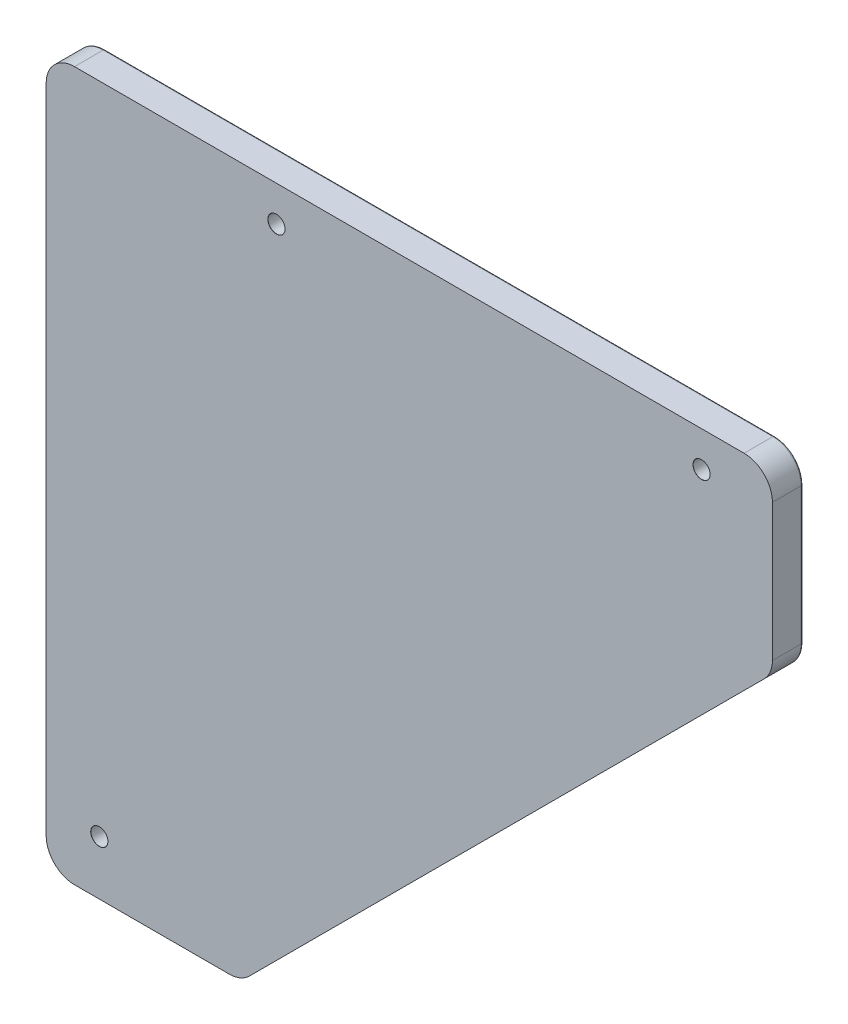
ISO-10303-21;
HEADER;
FILE_DESCRIPTION(('STEP AP214'),'2;1');
FILE_NAME('part.step','',(''),(''),'','','');
FILE_SCHEMA(('AUTOMOTIVE_DESIGN { 1 0 10303 214 1 1 1 1 }'));
ENDSEC;
DATA;
#1=APPLICATION_CONTEXT('core data for automotive mechanical design processes');
#2=APPLICATION_PROTOCOL_DEFINITION('international standard','automotive_design',2000,#1);
#3=PRODUCT_CONTEXT('',#1,'mechanical');
#4=PRODUCT('Part','Part','',(#3));
#5=PRODUCT_RELATED_PRODUCT_CATEGORY('part','',(#4));
#6=PRODUCT_DEFINITION_FORMATION('','',#4);
#7=PRODUCT_DEFINITION_CONTEXT('part definition',#1,'design');
#8=PRODUCT_DEFINITION('design','',#6,#7);
#9=PRODUCT_DEFINITION_SHAPE('','',#8);
#10=(LENGTH_UNIT() NAMED_UNIT(*) SI_UNIT(.MILLI.,.METRE.));
#11=(NAMED_UNIT(*) PLANE_ANGLE_UNIT() SI_UNIT($,.RADIAN.));
#12=(NAMED_UNIT(*) SI_UNIT($,.STERADIAN.) SOLID_ANGLE_UNIT());
#13=UNCERTAINTY_MEASURE_WITH_UNIT(LENGTH_MEASURE(1.E-05),#10,'distance_accuracy_value','');
#14=(GEOMETRIC_REPRESENTATION_CONTEXT(3) GLOBAL_UNCERTAINTY_ASSIGNED_CONTEXT((#13)) GLOBAL_UNIT_ASSIGNED_CONTEXT((#10,
#11,#12)) REPRESENTATION_CONTEXT('',''));
#15=CARTESIAN_POINT('',(0.,0.,0.));
#16=DIRECTION('',(0.,0.,1.));
#17=DIRECTION('',(1.,0.,0.));
#18=AXIS2_PLACEMENT_3D('',#15,#16,#17);
#19=CARTESIAN_POINT('',(-0.01000000000001,0.,8.6));
#20=DIRECTION('',(0.,0.,1.));
#21=DIRECTION('',(1.,0.,0.));
#22=AXIS2_PLACEMENT_3D('',#19,#20,#21);
#23=PLANE('',#22);
#24=CARTESIAN_POINT('',(8.,8.,8.6));
#25=DIRECTION('',(0.,0.,1.));
#26=DIRECTION('',(1.,0.,0.));
#27=AXIS2_PLACEMENT_3D('',#24,#25,#26);
#28=CIRCLE('',#27,8.);
#29=CARTESIAN_POINT('',(8.,0.,8.6));
#30=VERTEX_POINT('',#29);
#31=CARTESIAN_POINT('',(0.,8.,8.6));
#32=VERTEX_POINT('',#31);
#33=EDGE_CURVE('E156',#30,#32,#28,.F.);
#34=ORIENTED_EDGE('',*,*,#33,.F.);
#35=DIRECTION('',(1.,0.,0.));
#36=VECTOR('',#35,1.);
#37=CARTESIAN_POINT('',(-0.01000000000001,0.,8.6));
#38=LINE('',#37,#36);
#39=CARTESIAN_POINT('',(51.6862915010168,0.,8.6));
#40=VERTEX_POINT('',#39);
#41=EDGE_CURVE('E157',#30,#40,#38,.T.);
#42=ORIENTED_EDGE('',*,*,#41,.T.);
#43=CARTESIAN_POINT('',(51.6862915010168,8.00000000000001,8.6));
#44=DIRECTION('',(0.,0.,1.));
#45=DIRECTION('',(1.,0.,0.));
#46=AXIS2_PLACEMENT_3D('',#43,#44,#45);
#47=CIRCLE('',#46,8.);
#48=CARTESIAN_POINT('',(57.3431457505092,2.34314575050762,8.6));
#49=VERTEX_POINT('',#48);
#50=EDGE_CURVE('E145',#49,#40,#47,.F.);
#51=ORIENTED_EDGE('',*,*,#50,.F.);
#52=DIRECTION('',(0.707106781186544,0.707106781186551,0.));
#53=VECTOR('',#52,1.);
#54=CARTESIAN_POINT('',(205.,150.,8.6));
#55=LINE('',#54,#53);
#56=CARTESIAN_POINT('',(202.656854249492,147.656854249492,8.6));
#57=VERTEX_POINT('',#56);
#58=EDGE_CURVE('E164',#49,#57,#55,.T.);
#59=ORIENTED_EDGE('',*,*,#58,.T.);
#60=CARTESIAN_POINT('',(197.,153.313708498985,8.6));
#61=DIRECTION('',(0.,0.,1.));
#62=DIRECTION('',(1.,0.,0.));
#63=AXIS2_PLACEMENT_3D('',#60,#61,#62);
#64=CIRCLE('',#63,8.);
#65=CARTESIAN_POINT('',(205.,153.313708498985,8.6));
#66=VERTEX_POINT('',#65);
#67=EDGE_CURVE('E216',#66,#57,#64,.F.);
#68=ORIENTED_EDGE('',*,*,#67,.F.);
#69=DIRECTION('',(0.,1.,0.));
#70=VECTOR('',#69,1.);
#71=CARTESIAN_POINT('',(205.,200.,8.6));
#72=LINE('',#71,#70);
#73=CARTESIAN_POINT('',(205.,192.,8.6));
#74=VERTEX_POINT('',#73);
#75=EDGE_CURVE('E222',#66,#74,#72,.T.);
#76=ORIENTED_EDGE('',*,*,#75,.T.);
#77=CARTESIAN_POINT('',(197.,192.,8.6));
#78=DIRECTION('',(0.,0.,1.));
#79=DIRECTION('',(1.,0.,0.));
#80=AXIS2_PLACEMENT_3D('',#77,#78,#79);
#81=CIRCLE('',#80,8.);
#82=CARTESIAN_POINT('',(197.,200.,8.6));
#83=VERTEX_POINT('',#82);
#84=EDGE_CURVE('E213',#83,#74,#81,.F.);
#85=ORIENTED_EDGE('',*,*,#84,.F.);
#86=DIRECTION('',(-1.,0.,0.));
#87=VECTOR('',#86,1.);
#88=CARTESIAN_POINT('',(0.,200.,8.6));
#89=LINE('',#88,#87);
#90=CARTESIAN_POINT('',(8.,200.,8.6));
#91=VERTEX_POINT('',#90);
#92=EDGE_CURVE('E225',#83,#91,#89,.T.);
#93=ORIENTED_EDGE('',*,*,#92,.T.);
#94=CARTESIAN_POINT('',(8.,192.,8.6));
#95=DIRECTION('',(0.,0.,1.));
#96=DIRECTION('',(1.,0.,0.));
#97=AXIS2_PLACEMENT_3D('',#94,#95,#96);
#98=CIRCLE('',#97,8.);
#99=CARTESIAN_POINT('',(0.,192.,8.6));
#100=VERTEX_POINT('',#99);
#101=EDGE_CURVE('E218',#100,#91,#98,.F.);
#102=ORIENTED_EDGE('',*,*,#101,.F.);
#103=DIRECTION('',(0.,-1.,0.));
#104=VECTOR('',#103,1.);
#105=CARTESIAN_POINT('',(0.,0.,8.6));
#106=LINE('',#105,#104);
#107=EDGE_CURVE('E228',#100,#32,#106,.T.);
#108=ORIENTED_EDGE('',*,*,#107,.T.);
#109=EDGE_LOOP('',(#34,#42,#51,#59,#68,#76,#85,#93,#102,#108));
#110=FACE_BOUND('',#109,.T.);
#111=CARTESIAN_POINT('',(65.,190.,8.6));
#112=DIRECTION('',(0.,0.,1.));
#113=DIRECTION('',(1.,0.,0.));
#114=AXIS2_PLACEMENT_3D('',#111,#112,#113);
#115=CIRCLE('',#114,2.425);
#116=CARTESIAN_POINT('',(67.425,190.,8.6));
#117=VERTEX_POINT('',#116);
#118=EDGE_CURVE('E209',#117,#117,#115,.T.);
#119=ORIENTED_EDGE('',*,*,#118,.F.);
#120=EDGE_LOOP('',(#119));
#121=FACE_BOUND('',#120,.T.);
#122=CARTESIAN_POINT('',(185.,190.,8.6));
#123=DIRECTION('',(0.,0.,1.));
#124=DIRECTION('',(1.,0.,0.));
#125=AXIS2_PLACEMENT_3D('',#122,#123,#124);
#126=CIRCLE('',#125,2.42500000000001);
#127=CARTESIAN_POINT('',(187.425,190.,8.6));
#128=VERTEX_POINT('',#127);
#129=EDGE_CURVE('E200',#128,#128,#126,.T.);
#130=ORIENTED_EDGE('',*,*,#129,.F.);
#131=EDGE_LOOP('',(#130));
#132=FACE_BOUND('',#131,.T.);
#133=CARTESIAN_POINT('',(15.,15.29,8.6));
#134=DIRECTION('',(0.,0.,1.));
#135=DIRECTION('',(1.,0.,0.));
#136=AXIS2_PLACEMENT_3D('',#133,#134,#135);
#137=CIRCLE('',#136,2.425);
#138=CARTESIAN_POINT('',(17.425,15.29,8.6));
#139=VERTEX_POINT('',#138);
#140=EDGE_CURVE('E186',#139,#139,#137,.T.);
#141=ORIENTED_EDGE('',*,*,#140,.F.);
#142=EDGE_LOOP('',(#141));
#143=FACE_BOUND('',#142,.T.);
#144=ADVANCED_FACE('F35',(#110,#121,#132,#143),#23,.T.);
#145=CARTESIAN_POINT('',(65.,190.,8.6));
#146=DIRECTION('',(0.,0.,1.));
#147=DIRECTION('',(1.,0.,0.));
#148=AXIS2_PLACEMENT_3D('',#145,#146,#147);
#149=CYLINDRICAL_SURFACE('',#148,2.4);
#150=CARTESIAN_POINT('',(65.,190.,0.));
#151=DIRECTION('',(0.,0.,1.));
#152=DIRECTION('',(1.,0.,0.));
#153=AXIS2_PLACEMENT_3D('',#150,#151,#152);
#154=CIRCLE('',#153,2.4);
#155=CARTESIAN_POINT('',(67.4,190.,0.));
#156=VERTEX_POINT('',#155);
#157=EDGE_CURVE('E203',#156,#156,#154,.T.);
#158=ORIENTED_EDGE('',*,*,#157,.F.);
#159=EDGE_LOOP('',(#158));
#160=FACE_BOUND('',#159,.T.);
#161=CARTESIAN_POINT('',(65.,190.,8.575));
#162=DIRECTION('',(0.,0.,1.));
#163=DIRECTION('',(1.,0.,0.));
#164=AXIS2_PLACEMENT_3D('',#161,#162,#163);
#165=CIRCLE('',#164,2.4);
#166=CARTESIAN_POINT('',(67.4,190.,8.575));
#167=VERTEX_POINT('',#166);
#168=EDGE_CURVE('E206',#167,#167,#165,.T.);
#169=ORIENTED_EDGE('',*,*,#168,.T.);
#170=EDGE_LOOP('',(#169));
#171=FACE_BOUND('',#170,.T.);
#172=ADVANCED_FACE('F379',(#160,#171),#149,.F.);
#173=CARTESIAN_POINT('',(65.,190.,8.6));
#174=DIRECTION('',(0.,0.,1.));
#175=DIRECTION('',(1.,0.,0.));
#176=AXIS2_PLACEMENT_3D('',#173,#174,#175);
#177=CONICAL_SURFACE('',#176,2.425,0.785398163397379);
#178=ORIENTED_EDGE('',*,*,#168,.F.);
#179=EDGE_LOOP('',(#178));
#180=FACE_BOUND('',#179,.T.);
#181=ORIENTED_EDGE('',*,*,#118,.T.);
#182=EDGE_LOOP('',(#181));
#183=FACE_BOUND('',#182,.T.);
#184=ADVANCED_FACE('F371',(#180,#183),#177,.F.);
#185=CARTESIAN_POINT('',(8.,8.,109.6));
#186=DIRECTION('',(0.,0.,-1.));
#187=DIRECTION('',(-1.,0.,0.));
#188=AXIS2_PLACEMENT_3D('',#185,#186,#187);
#189=CYLINDRICAL_SURFACE('',#188,8.);
#190=DIRECTION('',(0.,0.,-1.));
#191=VECTOR('',#190,1.);
#192=CARTESIAN_POINT('',(8.,0.,109.6));
#193=LINE('',#192,#191);
#194=CARTESIAN_POINT('',(8.,0.,0.5));
#195=VERTEX_POINT('',#194);
#196=EDGE_CURVE('E169',#30,#195,#193,.T.);
#197=ORIENTED_EDGE('',*,*,#196,.F.);
#198=ORIENTED_EDGE('',*,*,#33,.T.);
#199=DIRECTION('',(0.,0.,-1.));
#200=VECTOR('',#199,1.);
#201=CARTESIAN_POINT('',(0.,8.,109.6));
#202=LINE('',#201,#200);
#203=CARTESIAN_POINT('',(0.,8.,0.5));
#204=VERTEX_POINT('',#203);
#205=EDGE_CURVE('E173',#204,#32,#202,.F.);
#206=ORIENTED_EDGE('',*,*,#205,.F.);
#207=CARTESIAN_POINT('',(8.,8.,0.5));
#208=DIRECTION('',(0.,0.,-1.));
#209=DIRECTION('',(-1.,0.,0.));
#210=AXIS2_PLACEMENT_3D('',#207,#208,#209);
#211=CIRCLE('',#210,8.);
#212=EDGE_CURVE('E249',#204,#195,#211,.F.);
#213=ORIENTED_EDGE('',*,*,#212,.T.);
#214=EDGE_LOOP('',(#197,#198,#206,#213));
#215=FACE_BOUND('',#214,.T.);
#216=ADVANCED_FACE('F248',(#215),#189,.T.);
#217=CARTESIAN_POINT('',(51.6862915010168,8.00000000000001,109.6));
#218=DIRECTION('',(0.,0.,-1.));
#219=DIRECTION('',(-1.,0.,0.));
#220=AXIS2_PLACEMENT_3D('',#217,#218,#219);
#221=CYLINDRICAL_SURFACE('',#220,8.);
#222=DIRECTION('',(0.,0.,-1.));
#223=VECTOR('',#222,1.);
#224=CARTESIAN_POINT('',(57.3431457505092,2.34314575050762,109.6));
#225=LINE('',#224,#223);
#226=CARTESIAN_POINT('',(57.3431457505092,2.34314575050762,0.5));
#227=VERTEX_POINT('',#226);
#228=EDGE_CURVE('E152',#49,#227,#225,.T.);
#229=ORIENTED_EDGE('',*,*,#228,.F.);
#230=ORIENTED_EDGE('',*,*,#50,.T.);
#231=DIRECTION('',(0.,0.,-1.));
#232=VECTOR('',#231,1.);
#233=CARTESIAN_POINT('',(51.6862915010168,0.,109.6));
#234=LINE('',#233,#232);
#235=CARTESIAN_POINT('',(51.6862915010168,0.,0.5));
#236=VERTEX_POINT('',#235);
#237=EDGE_CURVE('E150',#236,#40,#234,.F.);
#238=ORIENTED_EDGE('',*,*,#237,.F.);
#239=CARTESIAN_POINT('',(51.6862915010168,8.00000000000001,0.5));
#240=DIRECTION('',(0.,0.,-1.));
#241=DIRECTION('',(-1.,0.,0.));
#242=AXIS2_PLACEMENT_3D('',#239,#240,#241);
#243=CIRCLE('',#242,8.);
#244=EDGE_CURVE('E312',#236,#227,#243,.F.);
#245=ORIENTED_EDGE('',*,*,#244,.T.);
#246=EDGE_LOOP('',(#229,#230,#238,#245));
#247=FACE_BOUND('',#246,.T.);
#248=ADVANCED_FACE('F147',(#247),#221,.T.);
#249=CARTESIAN_POINT('',(55.0000000000016,0.5,0.5));
#250=DIRECTION('',(-1.,0.,0.));
#251=DIRECTION('',(0.,0.,1.));
#252=AXIS2_PLACEMENT_3D('',#249,#250,#251);
#253=CYLINDRICAL_SURFACE('',#252,0.5);
#254=CARTESIAN_POINT('',(51.6862915010168,0.5,0.5));
#255=DIRECTION('',(1.,0.,0.));
#256=DIRECTION('',(0.,0.,-1.));
#257=AXIS2_PLACEMENT_3D('',#254,#255,#256);
#258=CIRCLE('',#257,0.5);
#259=CARTESIAN_POINT('',(51.6862915010168,0.5,0.));
#260=VERTEX_POINT('',#259);
#261=EDGE_CURVE('E266',#236,#260,#258,.T.);
#262=ORIENTED_EDGE('',*,*,#261,.F.);
#263=DIRECTION('',(1.,0.,0.));
#264=VECTOR('',#263,1.);
#265=CARTESIAN_POINT('',(51.6862915010168,0.,0.5));
#266=LINE('',#265,#264);
#267=EDGE_CURVE('E168',#195,#236,#266,.T.);
#268=ORIENTED_EDGE('',*,*,#267,.F.);
#269=CARTESIAN_POINT('',(8.,0.5,0.5));
#270=DIRECTION('',(-1.,0.,0.));
#271=DIRECTION('',(0.,0.,1.));
#272=AXIS2_PLACEMENT_3D('',#269,#270,#271);
#273=CIRCLE('',#272,0.5);
#274=CARTESIAN_POINT('',(8.,0.499999999999999,0.));
#275=VERTEX_POINT('',#274);
#276=EDGE_CURVE('E212',#275,#195,#273,.T.);
#277=ORIENTED_EDGE('',*,*,#276,.F.);
#278=DIRECTION('',(1.,0.,0.));
#279=VECTOR('',#278,1.);
#280=CARTESIAN_POINT('',(8.00000000000001,0.5,0.));
#281=LINE('',#280,#279);
#282=EDGE_CURVE('E298',#260,#275,#281,.F.);
#283=ORIENTED_EDGE('',*,*,#282,.F.);
#284=EDGE_LOOP('',(#262,#268,#277,#283));
#285=FACE_BOUND('',#284,.T.);
#286=ADVANCED_FACE('F377',(#285),#253,.T.);
#287=CARTESIAN_POINT('',(0.,0.,109.6));
#288=DIRECTION('',(1.,0.,0.));
#289=DIRECTION('',(0.,0.,-1.));
#290=AXIS2_PLACEMENT_3D('',#287,#288,#289);
#291=PLANE('',#290);
#292=ORIENTED_EDGE('',*,*,#107,.F.);
#293=DIRECTION('',(0.,0.,-1.));
#294=VECTOR('',#293,1.);
#295=CARTESIAN_POINT('',(0.,192.,109.6));
#296=LINE('',#295,#294);
#297=CARTESIAN_POINT('',(0.,192.,0.5));
#298=VERTEX_POINT('',#297);
#299=EDGE_CURVE('E170',#100,#298,#296,.T.);
#300=ORIENTED_EDGE('',*,*,#299,.T.);
#301=DIRECTION('',(0.,-1.,0.));
#302=VECTOR('',#301,1.);
#303=CARTESIAN_POINT('',(0.,8.,0.5));
#304=LINE('',#303,#302);
#305=EDGE_CURVE('E244',#298,#204,#304,.T.);
#306=ORIENTED_EDGE('',*,*,#305,.T.);
#307=ORIENTED_EDGE('',*,*,#205,.T.);
#308=EDGE_LOOP('',(#292,#300,#306,#307));
#309=FACE_BOUND('',#308,.T.);
#310=ADVANCED_FACE('F241',(#309),#291,.F.);
#311=CARTESIAN_POINT('',(8.,8.,0.5));
#312=DIRECTION('',(0.,0.,-1.));
#313=DIRECTION('',(-1.,0.,0.));
#314=AXIS2_PLACEMENT_3D('',#311,#312,#313);
#315=TOROIDAL_SURFACE('',#314,7.5,0.5);
#316=ORIENTED_EDGE('',*,*,#276,.T.);
#317=ORIENTED_EDGE('',*,*,#212,.F.);
#318=CARTESIAN_POINT('',(0.5,8.,0.5));
#319=DIRECTION('',(0.,1.,0.));
#320=DIRECTION('',(0.,0.,1.));
#321=AXIS2_PLACEMENT_3D('',#318,#319,#320);
#322=CIRCLE('',#321,0.5);
#323=CARTESIAN_POINT('',(0.5,8.,0.));
#324=VERTEX_POINT('',#323);
#325=EDGE_CURVE('E256',#324,#204,#322,.T.);
#326=ORIENTED_EDGE('',*,*,#325,.F.);
#327=CARTESIAN_POINT('',(8.,8.,0.));
#328=DIRECTION('',(0.,0.,-1.));
#329=DIRECTION('',(-1.,0.,0.));
#330=AXIS2_PLACEMENT_3D('',#327,#328,#329);
#331=CIRCLE('',#330,7.5);
#332=EDGE_CURVE('E300',#275,#324,#331,.T.);
#333=ORIENTED_EDGE('',*,*,#332,.F.);
#334=EDGE_LOOP('',(#316,#317,#326,#333));
#335=FACE_BOUND('',#334,.T.);
#336=ADVANCED_FACE('F254',(#335),#315,.T.);
#337=CARTESIAN_POINT('',(205.,150.,109.6));
#338=DIRECTION('',(-0.707106781186551,0.707106781186544,0.));
#339=DIRECTION('',(-0.707106781186544,-0.707106781186551,0.));
#340=AXIS2_PLACEMENT_3D('',#337,#338,#339);
#341=PLANE('',#340);
#342=ORIENTED_EDGE('',*,*,#58,.F.);
#343=ORIENTED_EDGE('',*,*,#228,.T.);
#344=DIRECTION('',(0.707106781186544,0.707106781186551,0.));
#345=VECTOR('',#344,1.);
#346=CARTESIAN_POINT('',(202.656854249492,147.656854249492,0.5));
#347=LINE('',#346,#345);
#348=CARTESIAN_POINT('',(202.656854249492,147.656854249492,0.5));
#349=VERTEX_POINT('',#348);
#350=EDGE_CURVE('E314',#227,#349,#347,.T.);
#351=ORIENTED_EDGE('',*,*,#350,.T.);
#352=DIRECTION('',(0.,0.,-1.));
#353=VECTOR('',#352,1.);
#354=CARTESIAN_POINT('',(202.656854249492,147.656854249492,109.6));
#355=LINE('',#354,#353);
#356=EDGE_CURVE('E39',#349,#57,#355,.F.);
#357=ORIENTED_EDGE('',*,*,#356,.T.);
#358=EDGE_LOOP('',(#342,#343,#351,#357));
#359=FACE_BOUND('',#358,.T.);
#360=ADVANCED_FACE('F396',(#359),#341,.F.);
#361=CARTESIAN_POINT('',(51.6862915010168,8.00000000000001,0.5));
#362=DIRECTION('',(0.,0.,-1.));
#363=DIRECTION('',(-1.,0.,0.));
#364=AXIS2_PLACEMENT_3D('',#361,#362,#363);
#365=TOROIDAL_SURFACE('',#364,7.5,0.5);
#366=ORIENTED_EDGE('',*,*,#261,.T.);
#367=CARTESIAN_POINT('',(51.6862915010168,8.00000000000001,0.));
#368=DIRECTION('',(0.,0.,-1.));
#369=DIRECTION('',(-1.,0.,0.));
#370=AXIS2_PLACEMENT_3D('',#367,#368,#369);
#371=CIRCLE('',#370,7.5);
#372=CARTESIAN_POINT('',(56.9895923599159,2.6966991411009,0.));
#373=VERTEX_POINT('',#372);
#374=EDGE_CURVE('E296',#373,#260,#371,.T.);
#375=ORIENTED_EDGE('',*,*,#374,.F.);
#376=CARTESIAN_POINT('',(56.9895923599159,2.6966991411009,0.5));
#377=DIRECTION('',(0.707106781186549,0.707106781186546,0.));
#378=DIRECTION('',(-0.707106781186546,0.707106781186549,0.));
#379=AXIS2_PLACEMENT_3D('',#376,#377,#378);
#380=CIRCLE('',#379,0.5);
#381=EDGE_CURVE('E265',#227,#373,#380,.T.);
#382=ORIENTED_EDGE('',*,*,#381,.F.);
#383=ORIENTED_EDGE('',*,*,#244,.F.);
#384=EDGE_LOOP('',(#366,#375,#382,#383));
#385=FACE_BOUND('',#384,.T.);
#386=ADVANCED_FACE('F386',(#385),#365,.T.);
#387=CARTESIAN_POINT('',(8.,192.,109.6));
#388=DIRECTION('',(0.,0.,-1.));
#389=DIRECTION('',(-1.,0.,0.));
#390=AXIS2_PLACEMENT_3D('',#387,#388,#389);
#391=CYLINDRICAL_SURFACE('',#390,8.);
#392=ORIENTED_EDGE('',*,*,#299,.F.);
#393=ORIENTED_EDGE('',*,*,#101,.T.);
#394=DIRECTION('',(0.,0.,-1.));
#395=VECTOR('',#394,1.);
#396=CARTESIAN_POINT('',(8.,200.,109.6));
#397=LINE('',#396,#395);
#398=CARTESIAN_POINT('',(8.,200.,0.5));
#399=VERTEX_POINT('',#398);
#400=EDGE_CURVE('E234',#399,#91,#397,.F.);
#401=ORIENTED_EDGE('',*,*,#400,.F.);
#402=CARTESIAN_POINT('',(8.,192.,0.5));
#403=DIRECTION('',(0.,0.,-1.));
#404=DIRECTION('',(-1.,0.,0.));
#405=AXIS2_PLACEMENT_3D('',#402,#403,#404);
#406=CIRCLE('',#405,8.);
#407=EDGE_CURVE('E307',#399,#298,#406,.F.);
#408=ORIENTED_EDGE('',*,*,#407,.T.);
#409=EDGE_LOOP('',(#392,#393,#401,#408));
#410=FACE_BOUND('',#409,.T.);
#411=ADVANCED_FACE('F344',(#410),#391,.T.);
#412=CARTESIAN_POINT('',(0.5,0.,0.5));
#413=DIRECTION('',(0.,1.,0.));
#414=DIRECTION('',(0.,0.,1.));
#415=AXIS2_PLACEMENT_3D('',#412,#413,#414);
#416=CYLINDRICAL_SURFACE('',#415,0.5);
#417=ORIENTED_EDGE('',*,*,#325,.T.);
#418=ORIENTED_EDGE('',*,*,#305,.F.);
#419=CARTESIAN_POINT('',(0.5,192.,0.5));
#420=DIRECTION('',(0.,1.,0.));
#421=DIRECTION('',(0.,0.,1.));
#422=AXIS2_PLACEMENT_3D('',#419,#420,#421);
#423=CIRCLE('',#422,0.5);
#424=CARTESIAN_POINT('',(0.5,192.,0.));
#425=VERTEX_POINT('',#424);
#426=EDGE_CURVE('E269',#425,#298,#423,.T.);
#427=ORIENTED_EDGE('',*,*,#426,.F.);
#428=DIRECTION('',(0.,-1.,0.));
#429=VECTOR('',#428,1.);
#430=CARTESIAN_POINT('',(0.5,192.,0.));
#431=LINE('',#430,#429);
#432=EDGE_CURVE('E264',#324,#425,#431,.F.);
#433=ORIENTED_EDGE('',*,*,#432,.F.);
#434=EDGE_LOOP('',(#417,#418,#427,#433));
#435=FACE_BOUND('',#434,.T.);
#436=ADVANCED_FACE('F261',(#435),#416,.T.);
#437=CARTESIAN_POINT('',(197.,153.313708498985,109.6));
#438=DIRECTION('',(0.,0.,-1.));
#439=DIRECTION('',(-1.,0.,0.));
#440=AXIS2_PLACEMENT_3D('',#437,#438,#439);
#441=CYLINDRICAL_SURFACE('',#440,8.);
#442=DIRECTION('',(0.,0.,-1.));
#443=VECTOR('',#442,1.);
#444=CARTESIAN_POINT('',(205.,153.313708498985,109.6));
#445=LINE('',#444,#443);
#446=CARTESIAN_POINT('',(205.,153.313708498985,0.5));
#447=VERTEX_POINT('',#446);
#448=EDGE_CURVE('E230',#66,#447,#445,.T.);
#449=ORIENTED_EDGE('',*,*,#448,.F.);
#450=ORIENTED_EDGE('',*,*,#67,.T.);
#451=ORIENTED_EDGE('',*,*,#356,.F.);
#452=CARTESIAN_POINT('',(197.,153.313708498985,0.5));
#453=DIRECTION('',(0.,0.,-1.));
#454=DIRECTION('',(-1.,0.,0.));
#455=AXIS2_PLACEMENT_3D('',#452,#453,#454);
#456=CIRCLE('',#455,8.);
#457=EDGE_CURVE('E316',#349,#447,#456,.F.);
#458=ORIENTED_EDGE('',*,*,#457,.T.);
#459=EDGE_LOOP('',(#449,#450,#451,#458));
#460=FACE_BOUND('',#459,.T.);
#461=ADVANCED_FACE('F357',(#460),#441,.T.);
#462=CARTESIAN_POINT('',(204.646446609407,150.353553390593,0.5));
#463=DIRECTION('',(-0.707106781186544,-0.707106781186551,0.));
#464=DIRECTION('',(0.707106781186551,-0.707106781186544,0.));
#465=AXIS2_PLACEMENT_3D('',#462,#463,#464);
#466=CYLINDRICAL_SURFACE('',#465,0.5);
#467=ORIENTED_EDGE('',*,*,#381,.T.);
#468=DIRECTION('',(0.707106781186544,0.707106781186551,0.));
#469=VECTOR('',#468,1.);
#470=CARTESIAN_POINT('',(56.9895923599159,2.69669914110088,0.));
#471=LINE('',#470,#469);
#472=CARTESIAN_POINT('',(202.303300858899,148.010407640086,0.));
#473=VERTEX_POINT('',#472);
#474=EDGE_CURVE('E294',#473,#373,#471,.F.);
#475=ORIENTED_EDGE('',*,*,#474,.F.);
#476=CARTESIAN_POINT('',(202.303300858899,148.010407640086,0.5));
#477=DIRECTION('',(0.70710678118652,0.707106781186575,0.));
#478=DIRECTION('',(-0.707106781186575,0.70710678118652,0.));
#479=AXIS2_PLACEMENT_3D('',#476,#477,#478);
#480=CIRCLE('',#479,0.5);
#481=EDGE_CURVE('E276',#349,#473,#480,.T.);
#482=ORIENTED_EDGE('',*,*,#481,.F.);
#483=ORIENTED_EDGE('',*,*,#350,.F.);
#484=EDGE_LOOP('',(#467,#475,#482,#483));
#485=FACE_BOUND('',#484,.T.);
#486=ADVANCED_FACE('F349',(#485),#466,.T.);
#487=CARTESIAN_POINT('',(8.,192.,0.5));
#488=DIRECTION('',(0.,0.,-1.));
#489=DIRECTION('',(-1.,0.,0.));
#490=AXIS2_PLACEMENT_3D('',#487,#488,#489);
#491=TOROIDAL_SURFACE('',#490,7.5,0.5);
#492=ORIENTED_EDGE('',*,*,#426,.T.);
#493=ORIENTED_EDGE('',*,*,#407,.F.);
#494=CARTESIAN_POINT('',(8.,199.5,0.5));
#495=DIRECTION('',(1.,0.,0.));
#496=DIRECTION('',(0.,0.,-1.));
#497=AXIS2_PLACEMENT_3D('',#494,#495,#496);
#498=CIRCLE('',#497,0.5);
#499=CARTESIAN_POINT('',(8.,199.5,0.));
#500=VERTEX_POINT('',#499);
#501=EDGE_CURVE('E279',#500,#399,#498,.T.);
#502=ORIENTED_EDGE('',*,*,#501,.F.);
#503=CARTESIAN_POINT('',(8.,192.,0.));
#504=DIRECTION('',(0.,0.,-1.));
#505=DIRECTION('',(-1.,0.,0.));
#506=AXIS2_PLACEMENT_3D('',#503,#504,#505);
#507=CIRCLE('',#506,7.5);
#508=EDGE_CURVE('E303',#425,#500,#507,.T.);
#509=ORIENTED_EDGE('',*,*,#508,.F.);
#510=EDGE_LOOP('',(#492,#493,#502,#509));
#511=FACE_BOUND('',#510,.T.);
#512=ADVANCED_FACE('F346',(#511),#491,.T.);
#513=CARTESIAN_POINT('',(205.,200.,109.6));
#514=DIRECTION('',(-1.,0.,0.));
#515=DIRECTION('',(0.,0.,1.));
#516=AXIS2_PLACEMENT_3D('',#513,#514,#515);
#517=PLANE('',#516);
#518=ORIENTED_EDGE('',*,*,#75,.F.);
#519=ORIENTED_EDGE('',*,*,#448,.T.);
#520=DIRECTION('',(0.,1.,0.));
#521=VECTOR('',#520,1.);
#522=CARTESIAN_POINT('',(205.,192.,0.5));
#523=LINE('',#522,#521);
#524=CARTESIAN_POINT('',(205.,192.,0.5));
#525=VERTEX_POINT('',#524);
#526=EDGE_CURVE('E52',#447,#525,#523,.T.);
#527=ORIENTED_EDGE('',*,*,#526,.T.);
#528=DIRECTION('',(0.,0.,-1.));
#529=VECTOR('',#528,1.);
#530=CARTESIAN_POINT('',(205.,192.,109.6));
#531=LINE('',#530,#529);
#532=EDGE_CURVE('E232',#525,#74,#531,.F.);
#533=ORIENTED_EDGE('',*,*,#532,.T.);
#534=EDGE_LOOP('',(#518,#519,#527,#533));
#535=FACE_BOUND('',#534,.T.);
#536=ADVANCED_FACE('F348',(#535),#517,.F.);
#537=CARTESIAN_POINT('',(197.,153.313708498985,0.5));
#538=DIRECTION('',(0.,0.,-1.));
#539=DIRECTION('',(-1.,0.,0.));
#540=AXIS2_PLACEMENT_3D('',#537,#538,#539);
#541=TOROIDAL_SURFACE('',#540,7.5,0.5);
#542=ORIENTED_EDGE('',*,*,#481,.T.);
#543=CARTESIAN_POINT('',(197.,153.313708498985,0.));
#544=DIRECTION('',(0.,0.,-1.));
#545=DIRECTION('',(-1.,0.,0.));
#546=AXIS2_PLACEMENT_3D('',#543,#544,#545);
#547=CIRCLE('',#546,7.5);
#548=CARTESIAN_POINT('',(204.5,153.313708498985,0.));
#549=VERTEX_POINT('',#548);
#550=EDGE_CURVE('E292',#549,#473,#547,.T.);
#551=ORIENTED_EDGE('',*,*,#550,.F.);
#552=CARTESIAN_POINT('',(204.5,153.313708498985,0.5));
#553=DIRECTION('',(0.,1.,0.));
#554=DIRECTION('',(0.,0.,1.));
#555=AXIS2_PLACEMENT_3D('',#552,#553,#554);
#556=CIRCLE('',#555,0.5);
#557=EDGE_CURVE('E282',#447,#549,#556,.T.);
#558=ORIENTED_EDGE('',*,*,#557,.F.);
#559=ORIENTED_EDGE('',*,*,#457,.F.);
#560=EDGE_LOOP('',(#542,#551,#558,#559));
#561=FACE_BOUND('',#560,.T.);
#562=ADVANCED_FACE('F355',(#561),#541,.T.);
#563=CARTESIAN_POINT('',(204.5,200.,0.5));
#564=DIRECTION('',(0.,-1.,0.));
#565=DIRECTION('',(0.,0.,-1.));
#566=AXIS2_PLACEMENT_3D('',#563,#564,#565);
#567=CYLINDRICAL_SURFACE('',#566,0.5);
#568=ORIENTED_EDGE('',*,*,#557,.T.);
#569=DIRECTION('',(0.,1.,0.));
#570=VECTOR('',#569,1.);
#571=CARTESIAN_POINT('',(204.5,153.313708498985,0.));
#572=LINE('',#571,#570);
#573=CARTESIAN_POINT('',(204.5,192.,0.));
#574=VERTEX_POINT('',#573);
#575=EDGE_CURVE('E290',#574,#549,#572,.F.);
#576=ORIENTED_EDGE('',*,*,#575,.F.);
#577=CARTESIAN_POINT('',(204.5,192.,0.5));
#578=DIRECTION('',(0.,1.,0.));
#579=DIRECTION('',(0.,0.,1.));
#580=AXIS2_PLACEMENT_3D('',#577,#578,#579);
#581=CIRCLE('',#580,0.5);
#582=EDGE_CURVE('E11',#525,#574,#581,.T.);
#583=ORIENTED_EDGE('',*,*,#582,.F.);
#584=ORIENTED_EDGE('',*,*,#526,.F.);
#585=EDGE_LOOP('',(#568,#576,#583,#584));
#586=FACE_BOUND('',#585,.T.);
#587=ADVANCED_FACE('F329',(#586),#567,.T.);
#588=CARTESIAN_POINT('',(197.,192.,109.6));
#589=DIRECTION('',(0.,0.,-1.));
#590=DIRECTION('',(-1.,0.,0.));
#591=AXIS2_PLACEMENT_3D('',#588,#589,#590);
#592=CYLINDRICAL_SURFACE('',#591,8.);
#593=DIRECTION('',(0.,0.,-1.));
#594=VECTOR('',#593,1.);
#595=CARTESIAN_POINT('',(197.,200.,109.6));
#596=LINE('',#595,#594);
#597=CARTESIAN_POINT('',(197.,200.,0.5));
#598=VERTEX_POINT('',#597);
#599=EDGE_CURVE('E60',#83,#598,#596,.T.);
#600=ORIENTED_EDGE('',*,*,#599,.F.);
#601=ORIENTED_EDGE('',*,*,#84,.T.);
#602=ORIENTED_EDGE('',*,*,#532,.F.);
#603=CARTESIAN_POINT('',(197.,192.,0.5));
#604=DIRECTION('',(0.,0.,-1.));
#605=DIRECTION('',(-1.,0.,0.));
#606=AXIS2_PLACEMENT_3D('',#603,#604,#605);
#607=CIRCLE('',#606,8.);
#608=EDGE_CURVE('E189',#525,#598,#607,.F.);
#609=ORIENTED_EDGE('',*,*,#608,.T.);
#610=EDGE_LOOP('',(#600,#601,#602,#609));
#611=FACE_BOUND('',#610,.T.);
#612=ADVANCED_FACE('F37',(#611),#592,.T.);
#613=CARTESIAN_POINT('',(0.,199.5,0.5));
#614=DIRECTION('',(1.,0.,0.));
#615=DIRECTION('',(0.,0.,-1.));
#616=AXIS2_PLACEMENT_3D('',#613,#614,#615);
#617=CYLINDRICAL_SURFACE('',#616,0.5);
#618=ORIENTED_EDGE('',*,*,#501,.T.);
#619=DIRECTION('',(-1.,0.,0.));
#620=VECTOR('',#619,1.);
#621=CARTESIAN_POINT('',(8.,200.,0.5));
#622=LINE('',#621,#620);
#623=EDGE_CURVE('E215',#598,#399,#622,.T.);
#624=ORIENTED_EDGE('',*,*,#623,.F.);
#625=CARTESIAN_POINT('',(197.,199.5,0.5));
#626=DIRECTION('',(1.,0.,0.));
#627=DIRECTION('',(0.,0.,-1.));
#628=AXIS2_PLACEMENT_3D('',#625,#626,#627);
#629=CIRCLE('',#628,0.5);
#630=CARTESIAN_POINT('',(197.,199.5,0.));
#631=VERTEX_POINT('',#630);
#632=EDGE_CURVE('E44',#631,#598,#629,.T.);
#633=ORIENTED_EDGE('',*,*,#632,.F.);
#634=DIRECTION('',(-1.,0.,0.));
#635=VECTOR('',#634,1.);
#636=CARTESIAN_POINT('',(197.,199.5,0.));
#637=LINE('',#636,#635);
#638=EDGE_CURVE('E305',#500,#631,#637,.F.);
#639=ORIENTED_EDGE('',*,*,#638,.F.);
#640=EDGE_LOOP('',(#618,#624,#633,#639));
#641=FACE_BOUND('',#640,.T.);
#642=ADVANCED_FACE('F339',(#641),#617,.T.);
#643=CARTESIAN_POINT('',(197.,192.,0.5));
#644=DIRECTION('',(0.,0.,-1.));
#645=DIRECTION('',(-1.,0.,0.));
#646=AXIS2_PLACEMENT_3D('',#643,#644,#645);
#647=TOROIDAL_SURFACE('',#646,7.5,0.5);
#648=ORIENTED_EDGE('',*,*,#632,.T.);
#649=ORIENTED_EDGE('',*,*,#608,.F.);
#650=ORIENTED_EDGE('',*,*,#582,.T.);
#651=CARTESIAN_POINT('',(197.,192.,0.));
#652=DIRECTION('',(0.,0.,-1.));
#653=DIRECTION('',(-1.,0.,0.));
#654=AXIS2_PLACEMENT_3D('',#651,#652,#653);
#655=CIRCLE('',#654,7.5);
#656=EDGE_CURVE('E287',#631,#574,#655,.T.);
#657=ORIENTED_EDGE('',*,*,#656,.F.);
#658=EDGE_LOOP('',(#648,#649,#650,#657));
#659=FACE_BOUND('',#658,.T.);
#660=ADVANCED_FACE('F323',(#659),#647,.T.);
#661=CARTESIAN_POINT('',(0.,0.,0.));
#662=DIRECTION('',(0.,0.,-1.));
#663=DIRECTION('',(-1.,0.,0.));
#664=AXIS2_PLACEMENT_3D('',#661,#662,#663);
#665=PLANE('',#664);
#666=ORIENTED_EDGE('',*,*,#638,.T.);
#667=ORIENTED_EDGE('',*,*,#656,.T.);
#668=ORIENTED_EDGE('',*,*,#575,.T.);
#669=ORIENTED_EDGE('',*,*,#550,.T.);
#670=ORIENTED_EDGE('',*,*,#474,.T.);
#671=ORIENTED_EDGE('',*,*,#374,.T.);
#672=ORIENTED_EDGE('',*,*,#282,.T.);
#673=ORIENTED_EDGE('',*,*,#332,.T.);
#674=ORIENTED_EDGE('',*,*,#432,.T.);
#675=ORIENTED_EDGE('',*,*,#508,.T.);
#676=EDGE_LOOP('',(#666,#667,#668,#669,#670,#671,#672,#673,#674,#675));
#677=FACE_BOUND('',#676,.T.);
#678=ORIENTED_EDGE('',*,*,#157,.T.);
#679=EDGE_LOOP('',(#678));
#680=FACE_BOUND('',#679,.T.);
#681=CARTESIAN_POINT('',(185.,190.,0.));
#682=DIRECTION('',(0.,0.,1.));
#683=DIRECTION('',(1.,0.,0.));
#684=AXIS2_PLACEMENT_3D('',#681,#682,#683);
#685=CIRCLE('',#684,2.39999999999999);
#686=CARTESIAN_POINT('',(187.4,190.,0.));
#687=VERTEX_POINT('',#686);
#688=EDGE_CURVE('E194',#687,#687,#685,.T.);
#689=ORIENTED_EDGE('',*,*,#688,.T.);
#690=EDGE_LOOP('',(#689));
#691=FACE_BOUND('',#690,.T.);
#692=CARTESIAN_POINT('',(15.,15.29,0.));
#693=DIRECTION('',(0.,0.,1.));
#694=DIRECTION('',(1.,0.,0.));
#695=AXIS2_PLACEMENT_3D('',#692,#693,#694);
#696=CIRCLE('',#695,2.4);
#697=CARTESIAN_POINT('',(17.4,15.29,0.));
#698=VERTEX_POINT('',#697);
#699=EDGE_CURVE('E178',#698,#698,#696,.T.);
#700=ORIENTED_EDGE('',*,*,#699,.T.);
#701=EDGE_LOOP('',(#700));
#702=FACE_BOUND('',#701,.T.);
#703=ADVANCED_FACE('F333',(#677,#680,#691,#702),#665,.T.);
#704=CARTESIAN_POINT('',(0.,200.,109.6));
#705=DIRECTION('',(0.,-1.,0.));
#706=DIRECTION('',(0.,0.,-1.));
#707=AXIS2_PLACEMENT_3D('',#704,#705,#706);
#708=PLANE('',#707);
#709=ORIENTED_EDGE('',*,*,#92,.F.);
#710=ORIENTED_EDGE('',*,*,#599,.T.);
#711=ORIENTED_EDGE('',*,*,#623,.T.);
#712=ORIENTED_EDGE('',*,*,#400,.T.);
#713=EDGE_LOOP('',(#709,#710,#711,#712));
#714=FACE_BOUND('',#713,.T.);
#715=ADVANCED_FACE('F341',(#714),#708,.F.);
#716=CARTESIAN_POINT('',(55.0000000000016,0.,109.6));
#717=DIRECTION('',(0.,1.,0.));
#718=DIRECTION('',(0.,0.,1.));
#719=AXIS2_PLACEMENT_3D('',#716,#717,#718);
#720=PLANE('',#719);
#721=ORIENTED_EDGE('',*,*,#41,.F.);
#722=ORIENTED_EDGE('',*,*,#196,.T.);
#723=ORIENTED_EDGE('',*,*,#267,.T.);
#724=ORIENTED_EDGE('',*,*,#237,.T.);
#725=EDGE_LOOP('',(#721,#722,#723,#724));
#726=FACE_BOUND('',#725,.T.);
#727=ADVANCED_FACE('F166',(#726),#720,.F.);
#728=CARTESIAN_POINT('',(185.,190.,8.6));
#729=DIRECTION('',(0.,0.,1.));
#730=DIRECTION('',(1.,0.,0.));
#731=AXIS2_PLACEMENT_3D('',#728,#729,#730);
#732=CYLINDRICAL_SURFACE('',#731,2.39999999999999);
#733=ORIENTED_EDGE('',*,*,#688,.F.);
#734=EDGE_LOOP('',(#733));
#735=FACE_BOUND('',#734,.T.);
#736=CARTESIAN_POINT('',(185.,190.,8.575));
#737=DIRECTION('',(0.,0.,1.));
#738=DIRECTION('',(1.,0.,0.));
#739=AXIS2_PLACEMENT_3D('',#736,#737,#738);
#740=CIRCLE('',#739,2.39999999999999);
#741=CARTESIAN_POINT('',(187.4,190.,8.575));
#742=VERTEX_POINT('',#741);
#743=EDGE_CURVE('E197',#742,#742,#740,.T.);
#744=ORIENTED_EDGE('',*,*,#743,.T.);
#745=EDGE_LOOP('',(#744));
#746=FACE_BOUND('',#745,.T.);
#747=ADVANCED_FACE('F382',(#735,#746),#732,.F.);
#748=CARTESIAN_POINT('',(185.,190.,8.6));
#749=DIRECTION('',(0.,0.,1.));
#750=DIRECTION('',(1.,0.,0.));
#751=AXIS2_PLACEMENT_3D('',#748,#749,#750);
#752=CONICAL_SURFACE('',#751,2.42500000000001,0.785398163397934);
#753=ORIENTED_EDGE('',*,*,#743,.F.);
#754=EDGE_LOOP('',(#753));
#755=FACE_BOUND('',#754,.T.);
#756=ORIENTED_EDGE('',*,*,#129,.T.);
#757=EDGE_LOOP('',(#756));
#758=FACE_BOUND('',#757,.T.);
#759=ADVANCED_FACE('F552',(#755,#758),#752,.F.);
#760=CARTESIAN_POINT('',(15.,15.29,8.6));
#761=DIRECTION('',(0.,0.,1.));
#762=DIRECTION('',(1.,0.,0.));
#763=AXIS2_PLACEMENT_3D('',#760,#761,#762);
#764=CYLINDRICAL_SURFACE('',#763,2.4);
#765=ORIENTED_EDGE('',*,*,#699,.F.);
#766=EDGE_LOOP('',(#765));
#767=FACE_BOUND('',#766,.T.);
#768=CARTESIAN_POINT('',(15.,15.29,8.575));
#769=DIRECTION('',(0.,0.,1.));
#770=DIRECTION('',(1.,0.,0.));
#771=AXIS2_PLACEMENT_3D('',#768,#769,#770);
#772=CIRCLE('',#771,2.4);
#773=CARTESIAN_POINT('',(17.4,15.29,8.575));
#774=VERTEX_POINT('',#773);
#775=EDGE_CURVE('E181',#774,#774,#772,.T.);
#776=ORIENTED_EDGE('',*,*,#775,.T.);
#777=EDGE_LOOP('',(#776));
#778=FACE_BOUND('',#777,.T.);
#779=ADVANCED_FACE('F546',(#767,#778),#764,.F.);
#780=CARTESIAN_POINT('',(15.,15.29,8.6));
#781=DIRECTION('',(0.,0.,1.));
#782=DIRECTION('',(1.,0.,0.));
#783=AXIS2_PLACEMENT_3D('',#780,#781,#782);
#784=CONICAL_SURFACE('',#783,2.425,0.785398163397448);
#785=ORIENTED_EDGE('',*,*,#775,.F.);
#786=EDGE_LOOP('',(#785));
#787=FACE_BOUND('',#786,.T.);
#788=ORIENTED_EDGE('',*,*,#140,.T.);
#789=EDGE_LOOP('',(#788));
#790=FACE_BOUND('',#789,.T.);
#791=ADVANCED_FACE('F535',(#787,#790),#784,.F.);
#792=CLOSED_SHELL('',(#144,#172,#184,#216,#248,#286,#310,#336,#360,#386,#411,#436,#461,#486,
#512,#536,#562,#587,#612,#642,#660,#703,#715,#727,#747,#759,#779,#791));
#793=MANIFOLD_SOLID_BREP('B2',#792);
#794=ADVANCED_BREP_SHAPE_REPRESENTATION('',(#18,#793),#14);
#795=SHAPE_DEFINITION_REPRESENTATION(#9,#794);
ENDSEC;
END-ISO-10303-21;
